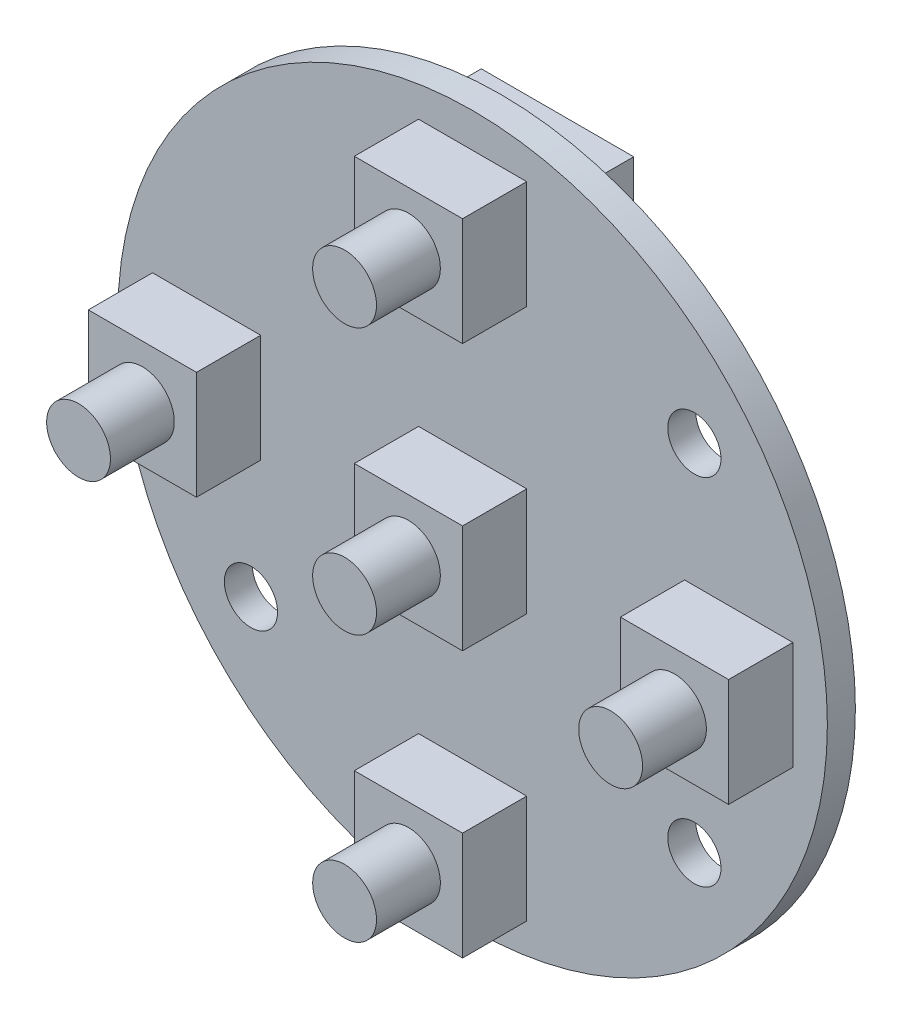
ISO-10303-21;
HEADER;
FILE_DESCRIPTION(('STEP AP214'),'2;1');
FILE_NAME('part.step','',(''),(''),'','','');
FILE_SCHEMA(('AUTOMOTIVE_DESIGN { 1 0 10303 214 1 1 1 1 }'));
ENDSEC;
DATA;
#1=APPLICATION_CONTEXT('core data for automotive mechanical design processes');
#2=APPLICATION_PROTOCOL_DEFINITION('international standard','automotive_design',2000,#1);
#3=PRODUCT_CONTEXT('',#1,'mechanical');
#4=PRODUCT('Part','Part','',(#3));
#5=PRODUCT_RELATED_PRODUCT_CATEGORY('part','',(#4));
#6=PRODUCT_DEFINITION_FORMATION('','',#4);
#7=PRODUCT_DEFINITION_CONTEXT('part definition',#1,'design');
#8=PRODUCT_DEFINITION('design','',#6,#7);
#9=PRODUCT_DEFINITION_SHAPE('','',#8);
#10=(LENGTH_UNIT() NAMED_UNIT(*) SI_UNIT(.MILLI.,.METRE.));
#11=(NAMED_UNIT(*) PLANE_ANGLE_UNIT() SI_UNIT($,.RADIAN.));
#12=(NAMED_UNIT(*) SI_UNIT($,.STERADIAN.) SOLID_ANGLE_UNIT());
#13=UNCERTAINTY_MEASURE_WITH_UNIT(LENGTH_MEASURE(1.E-05),#10,'distance_accuracy_value','');
#14=(GEOMETRIC_REPRESENTATION_CONTEXT(3) GLOBAL_UNCERTAINTY_ASSIGNED_CONTEXT((#13)) GLOBAL_UNIT_ASSIGNED_CONTEXT((#10,
#11,#12)) REPRESENTATION_CONTEXT('',''));
#15=CARTESIAN_POINT('',(0.,0.,0.));
#16=DIRECTION('',(0.,0.,1.));
#17=DIRECTION('',(1.,0.,0.));
#18=AXIS2_PLACEMENT_3D('',#15,#16,#17);
#19=CARTESIAN_POINT('',(0.,0.,1.58));
#20=DIRECTION('',(0.,0.,1.));
#21=DIRECTION('',(1.,0.,0.));
#22=AXIS2_PLACEMENT_3D('',#19,#20,#21);
#23=PLANE('',#22);
#24=CARTESIAN_POINT('',(12.5,-10.,1.58));
#25=DIRECTION('',(0.,0.,1.));
#26=DIRECTION('',(1.,0.,0.));
#27=AXIS2_PLACEMENT_3D('',#24,#25,#26);
#28=CIRCLE('',#27,1.5);
#29=CARTESIAN_POINT('',(14.,-10.,1.58));
#30=VERTEX_POINT('',#29);
#31=EDGE_CURVE('E441',#30,#30,#28,.T.);
#32=ORIENTED_EDGE('',*,*,#31,.F.);
#33=EDGE_LOOP('',(#32));
#34=FACE_BOUND('',#33,.T.);
#35=CARTESIAN_POINT('',(0.,0.,1.58));
#36=DIRECTION('',(0.,0.,1.));
#37=DIRECTION('',(1.,0.,0.));
#38=AXIS2_PLACEMENT_3D('',#35,#36,#37);
#39=CIRCLE('',#38,20.);
#40=CARTESIAN_POINT('',(20.,0.,1.58));
#41=VERTEX_POINT('',#40);
#42=EDGE_CURVE('E453',#41,#41,#39,.T.);
#43=ORIENTED_EDGE('',*,*,#42,.T.);
#44=EDGE_LOOP('',(#43));
#45=FACE_BOUND('',#44,.T.);
#46=CARTESIAN_POINT('',(-12.5,-10.,1.58));
#47=DIRECTION('',(0.,0.,1.));
#48=DIRECTION('',(1.,0.,0.));
#49=AXIS2_PLACEMENT_3D('',#46,#47,#48);
#50=CIRCLE('',#49,1.5);
#51=CARTESIAN_POINT('',(-11.,-10.,1.58));
#52=VERTEX_POINT('',#51);
#53=EDGE_CURVE('E447',#52,#52,#50,.T.);
#54=ORIENTED_EDGE('',*,*,#53,.F.);
#55=EDGE_LOOP('',(#54));
#56=FACE_BOUND('',#55,.T.);
#57=CARTESIAN_POINT('',(12.5,10.,1.58));
#58=DIRECTION('',(0.,0.,1.));
#59=DIRECTION('',(1.,0.,0.));
#60=AXIS2_PLACEMENT_3D('',#57,#58,#59);
#61=CIRCLE('',#60,1.5);
#62=CARTESIAN_POINT('',(14.,10.,1.58));
#63=VERTEX_POINT('',#62);
#64=EDGE_CURVE('E435',#63,#63,#61,.T.);
#65=ORIENTED_EDGE('',*,*,#64,.F.);
#66=EDGE_LOOP('',(#65));
#67=FACE_BOUND('',#66,.T.);
#68=DIRECTION('',(1.,0.,0.));
#69=VECTOR('',#68,1.);
#70=CARTESIAN_POINT('',(-18.05,-3.04999999999999,1.58));
#71=LINE('',#70,#69);
#72=CARTESIAN_POINT('',(-18.05,-3.04999999999999,1.58));
#73=VERTEX_POINT('',#72);
#74=CARTESIAN_POINT('',(-11.95,-3.04999999999999,1.58));
#75=VERTEX_POINT('',#74);
#76=EDGE_CURVE('E425',#73,#75,#71,.T.);
#77=ORIENTED_EDGE('',*,*,#76,.F.);
#78=DIRECTION('',(0.,-1.,0.));
#79=VECTOR('',#78,1.);
#80=CARTESIAN_POINT('',(-18.05,3.05,1.58));
#81=LINE('',#80,#79);
#82=CARTESIAN_POINT('',(-18.05,3.05,1.58));
#83=VERTEX_POINT('',#82);
#84=EDGE_CURVE('E422',#83,#73,#81,.T.);
#85=ORIENTED_EDGE('',*,*,#84,.F.);
#86=DIRECTION('',(-1.,0.,0.));
#87=VECTOR('',#86,1.);
#88=CARTESIAN_POINT('',(-18.05,3.05,1.58));
#89=LINE('',#88,#87);
#90=CARTESIAN_POINT('',(-11.95,3.05,1.58));
#91=VERTEX_POINT('',#90);
#92=EDGE_CURVE('E431',#91,#83,#89,.T.);
#93=ORIENTED_EDGE('',*,*,#92,.F.);
#94=DIRECTION('',(0.,1.,0.));
#95=VECTOR('',#94,1.);
#96=CARTESIAN_POINT('',(-11.95,3.05,1.58));
#97=LINE('',#96,#95);
#98=EDGE_CURVE('E428',#75,#91,#97,.T.);
#99=ORIENTED_EDGE('',*,*,#98,.F.);
#100=EDGE_LOOP('',(#77,#85,#93,#99));
#101=FACE_BOUND('',#100,.T.);
#102=DIRECTION('',(1.,0.,0.));
#103=VECTOR('',#102,1.);
#104=CARTESIAN_POINT('',(11.95,-3.04999999999999,1.58));
#105=LINE('',#104,#103);
#106=CARTESIAN_POINT('',(11.95,-3.04999999999999,1.58));
#107=VERTEX_POINT('',#106);
#108=CARTESIAN_POINT('',(18.05,-3.04999999999999,1.58));
#109=VERTEX_POINT('',#108);
#110=EDGE_CURVE('E413',#107,#109,#105,.T.);
#111=ORIENTED_EDGE('',*,*,#110,.F.);
#112=DIRECTION('',(0.,-1.,0.));
#113=VECTOR('',#112,1.);
#114=CARTESIAN_POINT('',(11.95,3.05,1.58));
#115=LINE('',#114,#113);
#116=CARTESIAN_POINT('',(11.95,3.05,1.58));
#117=VERTEX_POINT('',#116);
#118=EDGE_CURVE('E410',#117,#107,#115,.T.);
#119=ORIENTED_EDGE('',*,*,#118,.F.);
#120=DIRECTION('',(-1.,0.,0.));
#121=VECTOR('',#120,1.);
#122=CARTESIAN_POINT('',(11.95,3.05,1.58));
#123=LINE('',#122,#121);
#124=CARTESIAN_POINT('',(18.05,3.05,1.58));
#125=VERTEX_POINT('',#124);
#126=EDGE_CURVE('E419',#125,#117,#123,.T.);
#127=ORIENTED_EDGE('',*,*,#126,.F.);
#128=DIRECTION('',(0.,1.,0.));
#129=VECTOR('',#128,1.);
#130=CARTESIAN_POINT('',(18.05,3.05,1.58));
#131=LINE('',#130,#129);
#132=EDGE_CURVE('E416',#109,#125,#131,.T.);
#133=ORIENTED_EDGE('',*,*,#132,.F.);
#134=EDGE_LOOP('',(#111,#119,#127,#133));
#135=FACE_BOUND('',#134,.T.);
#136=DIRECTION('',(1.,0.,0.));
#137=VECTOR('',#136,1.);
#138=CARTESIAN_POINT('',(-3.05,11.95,1.58));
#139=LINE('',#138,#137);
#140=CARTESIAN_POINT('',(-3.05,11.95,1.58));
#141=VERTEX_POINT('',#140);
#142=CARTESIAN_POINT('',(3.05,11.95,1.58));
#143=VERTEX_POINT('',#142);
#144=EDGE_CURVE('E401',#141,#143,#139,.T.);
#145=ORIENTED_EDGE('',*,*,#144,.F.);
#146=DIRECTION('',(0.,-1.,0.));
#147=VECTOR('',#146,1.);
#148=CARTESIAN_POINT('',(-3.05,18.05,1.58));
#149=LINE('',#148,#147);
#150=CARTESIAN_POINT('',(-3.05,18.05,1.58));
#151=VERTEX_POINT('',#150);
#152=EDGE_CURVE('E398',#151,#141,#149,.T.);
#153=ORIENTED_EDGE('',*,*,#152,.F.);
#154=DIRECTION('',(-1.,0.,0.));
#155=VECTOR('',#154,1.);
#156=CARTESIAN_POINT('',(-3.05,18.05,1.58));
#157=LINE('',#156,#155);
#158=CARTESIAN_POINT('',(3.05,18.05,1.58));
#159=VERTEX_POINT('',#158);
#160=EDGE_CURVE('E407',#159,#151,#157,.T.);
#161=ORIENTED_EDGE('',*,*,#160,.F.);
#162=DIRECTION('',(0.,1.,0.));
#163=VECTOR('',#162,1.);
#164=CARTESIAN_POINT('',(3.05,18.05,1.58));
#165=LINE('',#164,#163);
#166=EDGE_CURVE('E404',#143,#159,#165,.T.);
#167=ORIENTED_EDGE('',*,*,#166,.F.);
#168=EDGE_LOOP('',(#145,#153,#161,#167));
#169=FACE_BOUND('',#168,.T.);
#170=DIRECTION('',(1.,0.,0.));
#171=VECTOR('',#170,1.);
#172=CARTESIAN_POINT('',(-3.04999999999999,-18.05,1.58));
#173=LINE('',#172,#171);
#174=CARTESIAN_POINT('',(-3.04999999999999,-18.05,1.58));
#175=VERTEX_POINT('',#174);
#176=CARTESIAN_POINT('',(3.05,-18.05,1.58));
#177=VERTEX_POINT('',#176);
#178=EDGE_CURVE('E389',#175,#177,#173,.T.);
#179=ORIENTED_EDGE('',*,*,#178,.F.);
#180=DIRECTION('',(0.,-1.,0.));
#181=VECTOR('',#180,1.);
#182=CARTESIAN_POINT('',(-3.05,-11.95,1.58));
#183=LINE('',#182,#181);
#184=CARTESIAN_POINT('',(-3.05,-11.95,1.58));
#185=VERTEX_POINT('',#184);
#186=EDGE_CURVE('E386',#185,#175,#183,.T.);
#187=ORIENTED_EDGE('',*,*,#186,.F.);
#188=DIRECTION('',(-1.,0.,0.));
#189=VECTOR('',#188,1.);
#190=CARTESIAN_POINT('',(-3.05,-11.95,1.58));
#191=LINE('',#190,#189);
#192=CARTESIAN_POINT('',(3.05,-11.95,1.58));
#193=VERTEX_POINT('',#192);
#194=EDGE_CURVE('E395',#193,#185,#191,.T.);
#195=ORIENTED_EDGE('',*,*,#194,.F.);
#196=DIRECTION('',(0.,1.,0.));
#197=VECTOR('',#196,1.);
#198=CARTESIAN_POINT('',(3.05,-11.95,1.58));
#199=LINE('',#198,#197);
#200=EDGE_CURVE('E392',#177,#193,#199,.T.);
#201=ORIENTED_EDGE('',*,*,#200,.F.);
#202=EDGE_LOOP('',(#179,#187,#195,#201));
#203=FACE_BOUND('',#202,.T.);
#204=DIRECTION('',(-1.,0.,0.));
#205=VECTOR('',#204,1.);
#206=CARTESIAN_POINT('',(-3.05,3.05,1.58));
#207=LINE('',#206,#205);
#208=CARTESIAN_POINT('',(3.05,3.05,1.58));
#209=VERTEX_POINT('',#208);
#210=CARTESIAN_POINT('',(-3.05,3.05,1.58));
#211=VERTEX_POINT('',#210);
#212=EDGE_CURVE('E380',#209,#211,#207,.T.);
#213=ORIENTED_EDGE('',*,*,#212,.F.);
#214=DIRECTION('',(0.,1.,0.));
#215=VECTOR('',#214,1.);
#216=CARTESIAN_POINT('',(3.05,-3.05,1.58));
#217=LINE('',#216,#215);
#218=CARTESIAN_POINT('',(3.05,-3.05,1.58));
#219=VERTEX_POINT('',#218);
#220=EDGE_CURVE('E369',#219,#209,#217,.T.);
#221=ORIENTED_EDGE('',*,*,#220,.F.);
#222=DIRECTION('',(1.,0.,0.));
#223=VECTOR('',#222,1.);
#224=CARTESIAN_POINT('',(-3.05,-3.05,1.58));
#225=LINE('',#224,#223);
#226=CARTESIAN_POINT('',(-3.05,-3.05,1.58));
#227=VERTEX_POINT('',#226);
#228=EDGE_CURVE('E55',#227,#219,#225,.T.);
#229=ORIENTED_EDGE('',*,*,#228,.F.);
#230=DIRECTION('',(0.,-1.,0.));
#231=VECTOR('',#230,1.);
#232=CARTESIAN_POINT('',(-3.05,-3.05,1.58));
#233=LINE('',#232,#231);
#234=EDGE_CURVE('E383',#211,#227,#233,.T.);
#235=ORIENTED_EDGE('',*,*,#234,.F.);
#236=EDGE_LOOP('',(#213,#221,#229,#235));
#237=FACE_BOUND('',#236,.T.);
#238=ADVANCED_FACE('F32',(#34,#45,#56,#67,#101,#135,#169,#203,#237),#23,.T.);
#239=CARTESIAN_POINT('',(0.,0.,0.));
#240=DIRECTION('',(0.,0.,1.));
#241=DIRECTION('',(1.,0.,0.));
#242=AXIS2_PLACEMENT_3D('',#239,#240,#241);
#243=PLANE('',#242);
#244=DIRECTION('',(1.,0.,0.));
#245=VECTOR('',#244,1.);
#246=CARTESIAN_POINT('',(-11.01,-9.52,0.));
#247=LINE('',#246,#245);
#248=CARTESIAN_POINT('',(-11.01,-9.52,0.));
#249=VERTEX_POINT('',#248);
#250=CARTESIAN_POINT('',(-2.42,-9.52,0.));
#251=VERTEX_POINT('',#250);
#252=EDGE_CURVE('E218',#249,#251,#247,.T.);
#253=ORIENTED_EDGE('',*,*,#252,.T.);
#254=DIRECTION('',(0.,1.,0.));
#255=VECTOR('',#254,1.);
#256=CARTESIAN_POINT('',(-2.42,10.78,0.));
#257=LINE('',#256,#255);
#258=CARTESIAN_POINT('',(-2.42,10.78,0.));
#259=VERTEX_POINT('',#258);
#260=EDGE_CURVE('E225',#251,#259,#257,.T.);
#261=ORIENTED_EDGE('',*,*,#260,.T.);
#262=DIRECTION('',(-1.,0.,0.));
#263=VECTOR('',#262,1.);
#264=CARTESIAN_POINT('',(-11.01,10.78,0.));
#265=LINE('',#264,#263);
#266=CARTESIAN_POINT('',(-11.01,10.78,0.));
#267=VERTEX_POINT('',#266);
#268=EDGE_CURVE('E198',#259,#267,#265,.T.);
#269=ORIENTED_EDGE('',*,*,#268,.T.);
#270=DIRECTION('',(0.,-1.,0.));
#271=VECTOR('',#270,1.);
#272=CARTESIAN_POINT('',(-11.01,10.78,0.));
#273=LINE('',#272,#271);
#274=EDGE_CURVE('E47',#267,#249,#273,.T.);
#275=ORIENTED_EDGE('',*,*,#274,.T.);
#276=EDGE_LOOP('',(#253,#261,#269,#275));
#277=FACE_BOUND('',#276,.T.);
#278=CARTESIAN_POINT('',(12.5,10.,0.));
#279=DIRECTION('',(0.,0.,1.));
#280=DIRECTION('',(1.,0.,0.));
#281=AXIS2_PLACEMENT_3D('',#278,#279,#280);
#282=CIRCLE('',#281,1.5);
#283=CARTESIAN_POINT('',(14.,10.,0.));
#284=VERTEX_POINT('',#283);
#285=EDGE_CURVE('E434',#284,#284,#282,.T.);
#286=ORIENTED_EDGE('',*,*,#285,.T.);
#287=EDGE_LOOP('',(#286));
#288=FACE_BOUND('',#287,.T.);
#289=CARTESIAN_POINT('',(12.5,-10.,0.));
#290=DIRECTION('',(0.,0.,1.));
#291=DIRECTION('',(1.,0.,0.));
#292=AXIS2_PLACEMENT_3D('',#289,#290,#291);
#293=CIRCLE('',#292,1.5);
#294=CARTESIAN_POINT('',(14.,-10.,0.));
#295=VERTEX_POINT('',#294);
#296=EDGE_CURVE('E438',#295,#295,#293,.T.);
#297=ORIENTED_EDGE('',*,*,#296,.T.);
#298=EDGE_LOOP('',(#297));
#299=FACE_BOUND('',#298,.T.);
#300=CARTESIAN_POINT('',(-12.5,-10.,0.));
#301=DIRECTION('',(0.,0.,1.));
#302=DIRECTION('',(1.,0.,0.));
#303=AXIS2_PLACEMENT_3D('',#300,#301,#302);
#304=CIRCLE('',#303,1.5);
#305=CARTESIAN_POINT('',(-11.,-10.,0.));
#306=VERTEX_POINT('',#305);
#307=EDGE_CURVE('E444',#306,#306,#304,.T.);
#308=ORIENTED_EDGE('',*,*,#307,.T.);
#309=EDGE_LOOP('',(#308));
#310=FACE_BOUND('',#309,.T.);
#311=CARTESIAN_POINT('',(0.,0.,0.));
#312=DIRECTION('',(0.,0.,1.));
#313=DIRECTION('',(1.,0.,0.));
#314=AXIS2_PLACEMENT_3D('',#311,#312,#313);
#315=CIRCLE('',#314,20.);
#316=CARTESIAN_POINT('',(20.,0.,0.));
#317=VERTEX_POINT('',#316);
#318=EDGE_CURVE('E450',#317,#317,#315,.T.);
#319=ORIENTED_EDGE('',*,*,#318,.F.);
#320=EDGE_LOOP('',(#319));
#321=FACE_BOUND('',#320,.T.);
#322=ADVANCED_FACE('F481',(#277,#288,#299,#310,#321),#243,.F.);
#323=CARTESIAN_POINT('',(0.,0.,1.58));
#324=DIRECTION('',(0.,0.,-1.));
#325=DIRECTION('',(-1.,0.,0.));
#326=AXIS2_PLACEMENT_3D('',#323,#324,#325);
#327=CYLINDRICAL_SURFACE('',#326,20.);
#328=ORIENTED_EDGE('',*,*,#42,.F.);
#329=EDGE_LOOP('',(#328));
#330=FACE_BOUND('',#329,.T.);
#331=ORIENTED_EDGE('',*,*,#318,.T.);
#332=EDGE_LOOP('',(#331));
#333=FACE_BOUND('',#332,.T.);
#334=ADVANCED_FACE('F34',(#330,#333),#327,.T.);
#335=CARTESIAN_POINT('',(-12.5,-10.,1.58));
#336=DIRECTION('',(0.,0.,-1.));
#337=DIRECTION('',(-1.,0.,0.));
#338=AXIS2_PLACEMENT_3D('',#335,#336,#337);
#339=CYLINDRICAL_SURFACE('',#338,1.5);
#340=ORIENTED_EDGE('',*,*,#53,.T.);
#341=EDGE_LOOP('',(#340));
#342=FACE_BOUND('',#341,.T.);
#343=ORIENTED_EDGE('',*,*,#307,.F.);
#344=EDGE_LOOP('',(#343));
#345=FACE_BOUND('',#344,.T.);
#346=ADVANCED_FACE('F577',(#342,#345),#339,.F.);
#347=CARTESIAN_POINT('',(12.5,-10.,1.58));
#348=DIRECTION('',(0.,0.,-1.));
#349=DIRECTION('',(-1.,0.,0.));
#350=AXIS2_PLACEMENT_3D('',#347,#348,#349);
#351=CYLINDRICAL_SURFACE('',#350,1.5);
#352=ORIENTED_EDGE('',*,*,#31,.T.);
#353=EDGE_LOOP('',(#352));
#354=FACE_BOUND('',#353,.T.);
#355=ORIENTED_EDGE('',*,*,#296,.F.);
#356=EDGE_LOOP('',(#355));
#357=FACE_BOUND('',#356,.T.);
#358=ADVANCED_FACE('F573',(#354,#357),#351,.F.);
#359=CARTESIAN_POINT('',(12.5,10.,1.58));
#360=DIRECTION('',(0.,0.,-1.));
#361=DIRECTION('',(-1.,0.,0.));
#362=AXIS2_PLACEMENT_3D('',#359,#360,#361);
#363=CYLINDRICAL_SURFACE('',#362,1.5);
#364=ORIENTED_EDGE('',*,*,#64,.T.);
#365=EDGE_LOOP('',(#364));
#366=FACE_BOUND('',#365,.T.);
#367=ORIENTED_EDGE('',*,*,#285,.F.);
#368=EDGE_LOOP('',(#367));
#369=FACE_BOUND('',#368,.T.);
#370=ADVANCED_FACE('F569',(#366,#369),#363,.F.);
#371=CARTESIAN_POINT('',(-3.05,18.05,5.2));
#372=DIRECTION('',(-1.,0.,0.));
#373=DIRECTION('',(0.,0.,1.));
#374=AXIS2_PLACEMENT_3D('',#371,#372,#373);
#375=PLANE('',#374);
#376=DIRECTION('',(0.,0.,-1.));
#377=VECTOR('',#376,1.);
#378=CARTESIAN_POINT('',(-3.05,18.05,5.2));
#379=LINE('',#378,#377);
#380=CARTESIAN_POINT('',(-3.05,18.05,5.2));
#381=VERTEX_POINT('',#380);
#382=EDGE_CURVE('E365',#381,#151,#379,.T.);
#383=ORIENTED_EDGE('',*,*,#382,.T.);
#384=ORIENTED_EDGE('',*,*,#152,.T.);
#385=DIRECTION('',(0.,0.,-1.));
#386=VECTOR('',#385,1.);
#387=CARTESIAN_POINT('',(-3.05,11.95,5.2));
#388=LINE('',#387,#386);
#389=CARTESIAN_POINT('',(-3.05,11.95,5.2));
#390=VERTEX_POINT('',#389);
#391=EDGE_CURVE('E366',#390,#141,#388,.T.);
#392=ORIENTED_EDGE('',*,*,#391,.F.);
#393=DIRECTION('',(0.,1.,0.));
#394=VECTOR('',#393,1.);
#395=CARTESIAN_POINT('',(-3.05,18.05,5.2));
#396=LINE('',#395,#394);
#397=EDGE_CURVE('E345',#390,#381,#396,.T.);
#398=ORIENTED_EDGE('',*,*,#397,.T.);
#399=EDGE_LOOP('',(#383,#384,#392,#398));
#400=FACE_BOUND('',#399,.T.);
#401=ADVANCED_FACE('F559',(#400),#375,.T.);
#402=CARTESIAN_POINT('',(-3.05,11.95,5.2));
#403=DIRECTION('',(0.,-1.,0.));
#404=DIRECTION('',(0.,0.,-1.));
#405=AXIS2_PLACEMENT_3D('',#402,#403,#404);
#406=PLANE('',#405);
#407=ORIENTED_EDGE('',*,*,#391,.T.);
#408=ORIENTED_EDGE('',*,*,#144,.T.);
#409=DIRECTION('',(0.,0.,-1.));
#410=VECTOR('',#409,1.);
#411=CARTESIAN_POINT('',(3.05,11.95,5.2));
#412=LINE('',#411,#410);
#413=CARTESIAN_POINT('',(3.05,11.95,5.2));
#414=VERTEX_POINT('',#413);
#415=EDGE_CURVE('E370',#414,#143,#412,.T.);
#416=ORIENTED_EDGE('',*,*,#415,.F.);
#417=DIRECTION('',(-1.,0.,0.));
#418=VECTOR('',#417,1.);
#419=CARTESIAN_POINT('',(-3.05,11.95,5.2));
#420=LINE('',#419,#418);
#421=EDGE_CURVE('E362',#414,#390,#420,.T.);
#422=ORIENTED_EDGE('',*,*,#421,.T.);
#423=EDGE_LOOP('',(#407,#408,#416,#422));
#424=FACE_BOUND('',#423,.T.);
#425=ADVANCED_FACE('F555',(#424),#406,.T.);
#426=CARTESIAN_POINT('',(3.05,18.05,5.2));
#427=DIRECTION('',(1.,0.,0.));
#428=DIRECTION('',(0.,0.,-1.));
#429=AXIS2_PLACEMENT_3D('',#426,#427,#428);
#430=PLANE('',#429);
#431=ORIENTED_EDGE('',*,*,#415,.T.);
#432=ORIENTED_EDGE('',*,*,#166,.T.);
#433=DIRECTION('',(0.,0.,-1.));
#434=VECTOR('',#433,1.);
#435=CARTESIAN_POINT('',(3.05,18.05,5.2));
#436=LINE('',#435,#434);
#437=CARTESIAN_POINT('',(3.05,18.05,5.2));
#438=VERTEX_POINT('',#437);
#439=EDGE_CURVE('E373',#438,#159,#436,.T.);
#440=ORIENTED_EDGE('',*,*,#439,.F.);
#441=DIRECTION('',(0.,-1.,0.));
#442=VECTOR('',#441,1.);
#443=CARTESIAN_POINT('',(3.05,18.05,5.2));
#444=LINE('',#443,#442);
#445=EDGE_CURVE('E359',#438,#414,#444,.T.);
#446=ORIENTED_EDGE('',*,*,#445,.T.);
#447=EDGE_LOOP('',(#431,#432,#440,#446));
#448=FACE_BOUND('',#447,.T.);
#449=ADVANCED_FACE('F558',(#448),#430,.T.);
#450=CARTESIAN_POINT('',(-3.05,18.05,5.2));
#451=DIRECTION('',(0.,1.,0.));
#452=DIRECTION('',(0.,0.,1.));
#453=AXIS2_PLACEMENT_3D('',#450,#451,#452);
#454=PLANE('',#453);
#455=ORIENTED_EDGE('',*,*,#439,.T.);
#456=ORIENTED_EDGE('',*,*,#160,.T.);
#457=ORIENTED_EDGE('',*,*,#382,.F.);
#458=DIRECTION('',(1.,0.,0.));
#459=VECTOR('',#458,1.);
#460=CARTESIAN_POINT('',(-3.05,18.05,5.2));
#461=LINE('',#460,#459);
#462=EDGE_CURVE('E356',#381,#438,#461,.T.);
#463=ORIENTED_EDGE('',*,*,#462,.T.);
#464=EDGE_LOOP('',(#455,#456,#457,#463));
#465=FACE_BOUND('',#464,.T.);
#466=ADVANCED_FACE('F553',(#465),#454,.T.);
#467=CARTESIAN_POINT('',(0.,0.,5.2));
#468=DIRECTION('',(0.,0.,1.));
#469=DIRECTION('',(1.,0.,0.));
#470=AXIS2_PLACEMENT_3D('',#467,#468,#469);
#471=PLANE('',#470);
#472=CARTESIAN_POINT('',(0.,15.,5.2));
#473=DIRECTION('',(0.,0.,1.));
#474=DIRECTION('',(1.,0.,0.));
#475=AXIS2_PLACEMENT_3D('',#472,#473,#474);
#476=CIRCLE('',#475,1.8);
#477=CARTESIAN_POINT('',(1.8,15.,5.2));
#478=VERTEX_POINT('',#477);
#479=EDGE_CURVE('E243',#478,#478,#476,.T.);
#480=ORIENTED_EDGE('',*,*,#479,.F.);
#481=EDGE_LOOP('',(#480));
#482=FACE_BOUND('',#481,.T.);
#483=ORIENTED_EDGE('',*,*,#397,.F.);
#484=ORIENTED_EDGE('',*,*,#421,.F.);
#485=ORIENTED_EDGE('',*,*,#445,.F.);
#486=ORIENTED_EDGE('',*,*,#462,.F.);
#487=EDGE_LOOP('',(#483,#484,#485,#486));
#488=FACE_BOUND('',#487,.T.);
#489=ADVANCED_FACE('F549',(#482,#488),#471,.T.);
#490=CARTESIAN_POINT('',(18.05,-3.04999999999999,5.2));
#491=DIRECTION('',(1.,0.,0.));
#492=DIRECTION('',(0.,0.,-1.));
#493=AXIS2_PLACEMENT_3D('',#490,#491,#492);
#494=PLANE('',#493);
#495=DIRECTION('',(0.,0.,-1.));
#496=VECTOR('',#495,1.);
#497=CARTESIAN_POINT('',(18.05,-3.04999999999999,5.2));
#498=LINE('',#497,#496);
#499=CARTESIAN_POINT('',(18.05,-3.04999999999999,5.2));
#500=VERTEX_POINT('',#499);
#501=EDGE_CURVE('E341',#500,#109,#498,.T.);
#502=ORIENTED_EDGE('',*,*,#501,.T.);
#503=ORIENTED_EDGE('',*,*,#132,.T.);
#504=DIRECTION('',(0.,0.,-1.));
#505=VECTOR('',#504,1.);
#506=CARTESIAN_POINT('',(18.05,3.05,5.2));
#507=LINE('',#506,#505);
#508=CARTESIAN_POINT('',(18.05,3.05,5.2));
#509=VERTEX_POINT('',#508);
#510=EDGE_CURVE('E342',#509,#125,#507,.T.);
#511=ORIENTED_EDGE('',*,*,#510,.F.);
#512=DIRECTION('',(0.,-1.,0.));
#513=VECTOR('',#512,1.);
#514=CARTESIAN_POINT('',(18.05,-3.04999999999999,5.2));
#515=LINE('',#514,#513);
#516=EDGE_CURVE('E321',#509,#500,#515,.T.);
#517=ORIENTED_EDGE('',*,*,#516,.T.);
#518=EDGE_LOOP('',(#502,#503,#511,#517));
#519=FACE_BOUND('',#518,.T.);
#520=ADVANCED_FACE('F539',(#519),#494,.T.);
#521=CARTESIAN_POINT('',(18.05,3.05,5.2));
#522=DIRECTION('',(0.,1.,0.));
#523=DIRECTION('',(0.,0.,1.));
#524=AXIS2_PLACEMENT_3D('',#521,#522,#523);
#525=PLANE('',#524);
#526=ORIENTED_EDGE('',*,*,#510,.T.);
#527=ORIENTED_EDGE('',*,*,#126,.T.);
#528=DIRECTION('',(0.,0.,-1.));
#529=VECTOR('',#528,1.);
#530=CARTESIAN_POINT('',(11.95,3.05,5.2));
#531=LINE('',#530,#529);
#532=CARTESIAN_POINT('',(11.95,3.05,5.2));
#533=VERTEX_POINT('',#532);
#534=EDGE_CURVE('E346',#533,#117,#531,.T.);
#535=ORIENTED_EDGE('',*,*,#534,.F.);
#536=DIRECTION('',(1.,0.,0.));
#537=VECTOR('',#536,1.);
#538=CARTESIAN_POINT('',(18.05,3.05,5.2));
#539=LINE('',#538,#537);
#540=EDGE_CURVE('E338',#533,#509,#539,.T.);
#541=ORIENTED_EDGE('',*,*,#540,.T.);
#542=EDGE_LOOP('',(#526,#527,#535,#541));
#543=FACE_BOUND('',#542,.T.);
#544=ADVANCED_FACE('F535',(#543),#525,.T.);
#545=CARTESIAN_POINT('',(11.95,-3.04999999999999,5.2));
#546=DIRECTION('',(-1.,0.,0.));
#547=DIRECTION('',(0.,0.,1.));
#548=AXIS2_PLACEMENT_3D('',#545,#546,#547);
#549=PLANE('',#548);
#550=ORIENTED_EDGE('',*,*,#534,.T.);
#551=ORIENTED_EDGE('',*,*,#118,.T.);
#552=DIRECTION('',(0.,0.,-1.));
#553=VECTOR('',#552,1.);
#554=CARTESIAN_POINT('',(11.95,-3.04999999999999,5.2));
#555=LINE('',#554,#553);
#556=CARTESIAN_POINT('',(11.95,-3.04999999999999,5.2));
#557=VERTEX_POINT('',#556);
#558=EDGE_CURVE('E349',#557,#107,#555,.T.);
#559=ORIENTED_EDGE('',*,*,#558,.F.);
#560=DIRECTION('',(0.,1.,0.));
#561=VECTOR('',#560,1.);
#562=CARTESIAN_POINT('',(11.95,-3.04999999999999,5.2));
#563=LINE('',#562,#561);
#564=EDGE_CURVE('E335',#557,#533,#563,.T.);
#565=ORIENTED_EDGE('',*,*,#564,.T.);
#566=EDGE_LOOP('',(#550,#551,#559,#565));
#567=FACE_BOUND('',#566,.T.);
#568=ADVANCED_FACE('F538',(#567),#549,.T.);
#569=CARTESIAN_POINT('',(18.05,-3.04999999999999,5.2));
#570=DIRECTION('',(0.,-1.,0.));
#571=DIRECTION('',(0.,0.,-1.));
#572=AXIS2_PLACEMENT_3D('',#569,#570,#571);
#573=PLANE('',#572);
#574=ORIENTED_EDGE('',*,*,#558,.T.);
#575=ORIENTED_EDGE('',*,*,#110,.T.);
#576=ORIENTED_EDGE('',*,*,#501,.F.);
#577=DIRECTION('',(-1.,0.,0.));
#578=VECTOR('',#577,1.);
#579=CARTESIAN_POINT('',(18.05,-3.04999999999999,5.2));
#580=LINE('',#579,#578);
#581=EDGE_CURVE('E332',#500,#557,#580,.T.);
#582=ORIENTED_EDGE('',*,*,#581,.T.);
#583=EDGE_LOOP('',(#574,#575,#576,#582));
#584=FACE_BOUND('',#583,.T.);
#585=ADVANCED_FACE('F533',(#584),#573,.T.);
#586=CARTESIAN_POINT('',(0.,0.,5.2));
#587=DIRECTION('',(0.,0.,1.));
#588=DIRECTION('',(1.,0.,0.));
#589=AXIS2_PLACEMENT_3D('',#586,#587,#588);
#590=PLANE('',#589);
#591=CARTESIAN_POINT('',(15.,0.,5.2));
#592=DIRECTION('',(0.,0.,1.));
#593=DIRECTION('',(1.,0.,0.));
#594=AXIS2_PLACEMENT_3D('',#591,#592,#593);
#595=CIRCLE('',#594,1.8);
#596=CARTESIAN_POINT('',(16.8,0.,5.2));
#597=VERTEX_POINT('',#596);
#598=EDGE_CURVE('E239',#597,#597,#595,.T.);
#599=ORIENTED_EDGE('',*,*,#598,.F.);
#600=EDGE_LOOP('',(#599));
#601=FACE_BOUND('',#600,.T.);
#602=ORIENTED_EDGE('',*,*,#516,.F.);
#603=ORIENTED_EDGE('',*,*,#540,.F.);
#604=ORIENTED_EDGE('',*,*,#564,.F.);
#605=ORIENTED_EDGE('',*,*,#581,.F.);
#606=EDGE_LOOP('',(#602,#603,#604,#605));
#607=FACE_BOUND('',#606,.T.);
#608=ADVANCED_FACE('F529',(#601,#607),#590,.T.);
#609=CARTESIAN_POINT('',(-11.95,3.05,5.2));
#610=DIRECTION('',(1.,0.,0.));
#611=DIRECTION('',(0.,0.,-1.));
#612=AXIS2_PLACEMENT_3D('',#609,#610,#611);
#613=PLANE('',#612);
#614=DIRECTION('',(0.,0.,-1.));
#615=VECTOR('',#614,1.);
#616=CARTESIAN_POINT('',(-11.95,-3.04999999999999,5.2));
#617=LINE('',#616,#615);
#618=CARTESIAN_POINT('',(-11.95,-3.04999999999999,5.2));
#619=VERTEX_POINT('',#618);
#620=EDGE_CURVE('E317',#619,#75,#617,.T.);
#621=ORIENTED_EDGE('',*,*,#620,.T.);
#622=ORIENTED_EDGE('',*,*,#98,.T.);
#623=DIRECTION('',(0.,0.,-1.));
#624=VECTOR('',#623,1.);
#625=CARTESIAN_POINT('',(-11.95,3.05,5.2));
#626=LINE('',#625,#624);
#627=CARTESIAN_POINT('',(-11.95,3.05,5.2));
#628=VERTEX_POINT('',#627);
#629=EDGE_CURVE('E318',#628,#91,#626,.T.);
#630=ORIENTED_EDGE('',*,*,#629,.F.);
#631=DIRECTION('',(0.,-1.,0.));
#632=VECTOR('',#631,1.);
#633=CARTESIAN_POINT('',(-11.95,3.05,5.2));
#634=LINE('',#633,#632);
#635=EDGE_CURVE('E297',#628,#619,#634,.T.);
#636=ORIENTED_EDGE('',*,*,#635,.T.);
#637=EDGE_LOOP('',(#621,#622,#630,#636));
#638=FACE_BOUND('',#637,.T.);
#639=ADVANCED_FACE('F519',(#638),#613,.T.);
#640=CARTESIAN_POINT('',(-11.95,3.05,5.2));
#641=DIRECTION('',(0.,1.,0.));
#642=DIRECTION('',(0.,0.,1.));
#643=AXIS2_PLACEMENT_3D('',#640,#641,#642);
#644=PLANE('',#643);
#645=ORIENTED_EDGE('',*,*,#629,.T.);
#646=ORIENTED_EDGE('',*,*,#92,.T.);
#647=DIRECTION('',(0.,0.,-1.));
#648=VECTOR('',#647,1.);
#649=CARTESIAN_POINT('',(-18.05,3.05,5.2));
#650=LINE('',#649,#648);
#651=CARTESIAN_POINT('',(-18.05,3.05,5.2));
#652=VERTEX_POINT('',#651);
#653=EDGE_CURVE('E322',#652,#83,#650,.T.);
#654=ORIENTED_EDGE('',*,*,#653,.F.);
#655=DIRECTION('',(1.,0.,0.));
#656=VECTOR('',#655,1.);
#657=CARTESIAN_POINT('',(-11.95,3.05,5.2));
#658=LINE('',#657,#656);
#659=EDGE_CURVE('E314',#652,#628,#658,.T.);
#660=ORIENTED_EDGE('',*,*,#659,.T.);
#661=EDGE_LOOP('',(#645,#646,#654,#660));
#662=FACE_BOUND('',#661,.T.);
#663=ADVANCED_FACE('F515',(#662),#644,.T.);
#664=CARTESIAN_POINT('',(-18.05,3.05,5.2));
#665=DIRECTION('',(-1.,0.,0.));
#666=DIRECTION('',(0.,0.,1.));
#667=AXIS2_PLACEMENT_3D('',#664,#665,#666);
#668=PLANE('',#667);
#669=ORIENTED_EDGE('',*,*,#653,.T.);
#670=ORIENTED_EDGE('',*,*,#84,.T.);
#671=DIRECTION('',(0.,0.,-1.));
#672=VECTOR('',#671,1.);
#673=CARTESIAN_POINT('',(-18.05,-3.04999999999999,5.2));
#674=LINE('',#673,#672);
#675=CARTESIAN_POINT('',(-18.05,-3.04999999999999,5.2));
#676=VERTEX_POINT('',#675);
#677=EDGE_CURVE('E325',#676,#73,#674,.T.);
#678=ORIENTED_EDGE('',*,*,#677,.F.);
#679=DIRECTION('',(0.,1.,0.));
#680=VECTOR('',#679,1.);
#681=CARTESIAN_POINT('',(-18.05,3.05,5.2));
#682=LINE('',#681,#680);
#683=EDGE_CURVE('E311',#676,#652,#682,.T.);
#684=ORIENTED_EDGE('',*,*,#683,.T.);
#685=EDGE_LOOP('',(#669,#670,#678,#684));
#686=FACE_BOUND('',#685,.T.);
#687=ADVANCED_FACE('F518',(#686),#668,.T.);
#688=CARTESIAN_POINT('',(-11.95,-3.04999999999999,5.2));
#689=DIRECTION('',(0.,-1.,0.));
#690=DIRECTION('',(0.,0.,-1.));
#691=AXIS2_PLACEMENT_3D('',#688,#689,#690);
#692=PLANE('',#691);
#693=ORIENTED_EDGE('',*,*,#677,.T.);
#694=ORIENTED_EDGE('',*,*,#76,.T.);
#695=ORIENTED_EDGE('',*,*,#620,.F.);
#696=DIRECTION('',(-1.,0.,0.));
#697=VECTOR('',#696,1.);
#698=CARTESIAN_POINT('',(-11.95,-3.04999999999999,5.2));
#699=LINE('',#698,#697);
#700=EDGE_CURVE('E308',#619,#676,#699,.T.);
#701=ORIENTED_EDGE('',*,*,#700,.T.);
#702=EDGE_LOOP('',(#693,#694,#695,#701));
#703=FACE_BOUND('',#702,.T.);
#704=ADVANCED_FACE('F513',(#703),#692,.T.);
#705=CARTESIAN_POINT('',(0.,0.,5.2));
#706=DIRECTION('',(0.,0.,-1.));
#707=DIRECTION('',(-1.,0.,0.));
#708=AXIS2_PLACEMENT_3D('',#705,#706,#707);
#709=PLANE('',#708);
#710=CARTESIAN_POINT('',(-15.,0.,5.2));
#711=DIRECTION('',(0.,0.,-1.));
#712=DIRECTION('',(-1.,0.,0.));
#713=AXIS2_PLACEMENT_3D('',#710,#711,#712);
#714=CIRCLE('',#713,1.8);
#715=CARTESIAN_POINT('',(-16.8,0.,5.2));
#716=VERTEX_POINT('',#715);
#717=EDGE_CURVE('E11',#716,#716,#714,.F.);
#718=ORIENTED_EDGE('',*,*,#717,.F.);
#719=EDGE_LOOP('',(#718));
#720=FACE_BOUND('',#719,.T.);
#721=ORIENTED_EDGE('',*,*,#635,.F.);
#722=ORIENTED_EDGE('',*,*,#659,.F.);
#723=ORIENTED_EDGE('',*,*,#683,.F.);
#724=ORIENTED_EDGE('',*,*,#700,.F.);
#725=EDGE_LOOP('',(#721,#722,#723,#724));
#726=FACE_BOUND('',#725,.T.);
#727=ADVANCED_FACE('F510',(#720,#726),#709,.F.);
#728=CARTESIAN_POINT('',(3.05,-3.05,5.2));
#729=DIRECTION('',(1.,0.,0.));
#730=DIRECTION('',(0.,0.,-1.));
#731=AXIS2_PLACEMENT_3D('',#728,#729,#730);
#732=PLANE('',#731);
#733=DIRECTION('',(0.,0.,-1.));
#734=VECTOR('',#733,1.);
#735=CARTESIAN_POINT('',(3.05,-3.05,5.2));
#736=LINE('',#735,#734);
#737=CARTESIAN_POINT('',(3.05,-3.05,5.2));
#738=VERTEX_POINT('',#737);
#739=EDGE_CURVE('E293',#738,#219,#736,.T.);
#740=ORIENTED_EDGE('',*,*,#739,.T.);
#741=ORIENTED_EDGE('',*,*,#220,.T.);
#742=DIRECTION('',(0.,0.,-1.));
#743=VECTOR('',#742,1.);
#744=CARTESIAN_POINT('',(3.05,3.05,5.2));
#745=LINE('',#744,#743);
#746=CARTESIAN_POINT('',(3.05,3.05,5.2));
#747=VERTEX_POINT('',#746);
#748=EDGE_CURVE('E294',#747,#209,#745,.T.);
#749=ORIENTED_EDGE('',*,*,#748,.F.);
#750=DIRECTION('',(0.,-1.,0.));
#751=VECTOR('',#750,1.);
#752=CARTESIAN_POINT('',(3.05,-3.05,5.2));
#753=LINE('',#752,#751);
#754=EDGE_CURVE('E273',#747,#738,#753,.T.);
#755=ORIENTED_EDGE('',*,*,#754,.T.);
#756=EDGE_LOOP('',(#740,#741,#749,#755));
#757=FACE_BOUND('',#756,.T.);
#758=ADVANCED_FACE('F486',(#757),#732,.T.);
#759=CARTESIAN_POINT('',(3.05,3.05,5.2));
#760=DIRECTION('',(0.,1.,0.));
#761=DIRECTION('',(0.,0.,1.));
#762=AXIS2_PLACEMENT_3D('',#759,#760,#761);
#763=PLANE('',#762);
#764=ORIENTED_EDGE('',*,*,#748,.T.);
#765=ORIENTED_EDGE('',*,*,#212,.T.);
#766=DIRECTION('',(0.,0.,-1.));
#767=VECTOR('',#766,1.);
#768=CARTESIAN_POINT('',(-3.05,3.05,5.2));
#769=LINE('',#768,#767);
#770=CARTESIAN_POINT('',(-3.05,3.05,5.2));
#771=VERTEX_POINT('',#770);
#772=EDGE_CURVE('E298',#771,#211,#769,.T.);
#773=ORIENTED_EDGE('',*,*,#772,.F.);
#774=DIRECTION('',(1.,0.,0.));
#775=VECTOR('',#774,1.);
#776=CARTESIAN_POINT('',(3.05,3.05,5.2));
#777=LINE('',#776,#775);
#778=EDGE_CURVE('E290',#771,#747,#777,.T.);
#779=ORIENTED_EDGE('',*,*,#778,.T.);
#780=EDGE_LOOP('',(#764,#765,#773,#779));
#781=FACE_BOUND('',#780,.T.);
#782=ADVANCED_FACE('F488',(#781),#763,.T.);
#783=CARTESIAN_POINT('',(-3.05,-3.05,5.2));
#784=DIRECTION('',(-1.,0.,0.));
#785=DIRECTION('',(0.,0.,1.));
#786=AXIS2_PLACEMENT_3D('',#783,#784,#785);
#787=PLANE('',#786);
#788=ORIENTED_EDGE('',*,*,#772,.T.);
#789=ORIENTED_EDGE('',*,*,#234,.T.);
#790=DIRECTION('',(0.,0.,-1.));
#791=VECTOR('',#790,1.);
#792=CARTESIAN_POINT('',(-3.05,-3.05,5.2));
#793=LINE('',#792,#791);
#794=CARTESIAN_POINT('',(-3.05,-3.05,5.2));
#795=VERTEX_POINT('',#794);
#796=EDGE_CURVE('E301',#795,#227,#793,.T.);
#797=ORIENTED_EDGE('',*,*,#796,.F.);
#798=DIRECTION('',(0.,1.,0.));
#799=VECTOR('',#798,1.);
#800=CARTESIAN_POINT('',(-3.05,-3.05,5.2));
#801=LINE('',#800,#799);
#802=EDGE_CURVE('E287',#795,#771,#801,.T.);
#803=ORIENTED_EDGE('',*,*,#802,.T.);
#804=EDGE_LOOP('',(#788,#789,#797,#803));
#805=FACE_BOUND('',#804,.T.);
#806=ADVANCED_FACE('F497',(#805),#787,.T.);
#807=CARTESIAN_POINT('',(3.05,-3.05,5.2));
#808=DIRECTION('',(0.,-1.,0.));
#809=DIRECTION('',(0.,0.,-1.));
#810=AXIS2_PLACEMENT_3D('',#807,#808,#809);
#811=PLANE('',#810);
#812=ORIENTED_EDGE('',*,*,#796,.T.);
#813=ORIENTED_EDGE('',*,*,#228,.T.);
#814=ORIENTED_EDGE('',*,*,#739,.F.);
#815=DIRECTION('',(-1.,0.,0.));
#816=VECTOR('',#815,1.);
#817=CARTESIAN_POINT('',(3.05,-3.05,5.2));
#818=LINE('',#817,#816);
#819=EDGE_CURVE('E284',#738,#795,#818,.T.);
#820=ORIENTED_EDGE('',*,*,#819,.T.);
#821=EDGE_LOOP('',(#812,#813,#814,#820));
#822=FACE_BOUND('',#821,.T.);
#823=ADVANCED_FACE('F495',(#822),#811,.T.);
#824=CARTESIAN_POINT('',(0.,0.,5.2));
#825=DIRECTION('',(0.,0.,1.));
#826=DIRECTION('',(1.,0.,0.));
#827=AXIS2_PLACEMENT_3D('',#824,#825,#826);
#828=PLANE('',#827);
#829=CARTESIAN_POINT('',(0.,0.,5.2));
#830=DIRECTION('',(0.,0.,1.));
#831=DIRECTION('',(1.,0.,0.));
#832=AXIS2_PLACEMENT_3D('',#829,#830,#831);
#833=CIRCLE('',#832,1.8);
#834=CARTESIAN_POINT('',(1.8,0.,5.2));
#835=VERTEX_POINT('',#834);
#836=EDGE_CURVE('E249',#835,#835,#833,.T.);
#837=ORIENTED_EDGE('',*,*,#836,.F.);
#838=EDGE_LOOP('',(#837));
#839=FACE_BOUND('',#838,.T.);
#840=ORIENTED_EDGE('',*,*,#754,.F.);
#841=ORIENTED_EDGE('',*,*,#778,.F.);
#842=ORIENTED_EDGE('',*,*,#802,.F.);
#843=ORIENTED_EDGE('',*,*,#819,.F.);
#844=EDGE_LOOP('',(#840,#841,#842,#843));
#845=FACE_BOUND('',#844,.T.);
#846=ADVANCED_FACE('F492',(#839,#845),#828,.T.);
#847=CARTESIAN_POINT('',(3.05,-11.95,5.2));
#848=DIRECTION('',(1.,0.,0.));
#849=DIRECTION('',(0.,0.,-1.));
#850=AXIS2_PLACEMENT_3D('',#847,#848,#849);
#851=PLANE('',#850);
#852=DIRECTION('',(0.,0.,-1.));
#853=VECTOR('',#852,1.);
#854=CARTESIAN_POINT('',(3.05,-18.05,5.2));
#855=LINE('',#854,#853);
#856=CARTESIAN_POINT('',(3.05,-18.05,5.2));
#857=VERTEX_POINT('',#856);
#858=EDGE_CURVE('E269',#857,#177,#855,.T.);
#859=ORIENTED_EDGE('',*,*,#858,.T.);
#860=ORIENTED_EDGE('',*,*,#200,.T.);
#861=DIRECTION('',(0.,0.,-1.));
#862=VECTOR('',#861,1.);
#863=CARTESIAN_POINT('',(3.05,-11.95,5.2));
#864=LINE('',#863,#862);
#865=CARTESIAN_POINT('',(3.05,-11.95,5.2));
#866=VERTEX_POINT('',#865);
#867=EDGE_CURVE('E270',#866,#193,#864,.T.);
#868=ORIENTED_EDGE('',*,*,#867,.F.);
#869=DIRECTION('',(0.,-1.,0.));
#870=VECTOR('',#869,1.);
#871=CARTESIAN_POINT('',(3.05,-11.95,5.2));
#872=LINE('',#871,#870);
#873=EDGE_CURVE('E255',#866,#857,#872,.T.);
#874=ORIENTED_EDGE('',*,*,#873,.T.);
#875=EDGE_LOOP('',(#859,#860,#868,#874));
#876=FACE_BOUND('',#875,.T.);
#877=ADVANCED_FACE('F478',(#876),#851,.T.);
#878=CARTESIAN_POINT('',(3.05,-11.95,5.2));
#879=DIRECTION('',(0.,1.,0.));
#880=DIRECTION('',(0.,0.,1.));
#881=AXIS2_PLACEMENT_3D('',#878,#879,#880);
#882=PLANE('',#881);
#883=ORIENTED_EDGE('',*,*,#867,.T.);
#884=ORIENTED_EDGE('',*,*,#194,.T.);
#885=DIRECTION('',(0.,0.,-1.));
#886=VECTOR('',#885,1.);
#887=CARTESIAN_POINT('',(-3.04999999999999,-11.95,5.2));
#888=LINE('',#887,#886);
#889=CARTESIAN_POINT('',(-3.04999999999999,-11.95,5.2));
#890=VERTEX_POINT('',#889);
#891=EDGE_CURVE('E274',#890,#185,#888,.T.);
#892=ORIENTED_EDGE('',*,*,#891,.F.);
#893=DIRECTION('',(1.,0.,0.));
#894=VECTOR('',#893,1.);
#895=CARTESIAN_POINT('',(3.05,-11.95,5.2));
#896=LINE('',#895,#894);
#897=EDGE_CURVE('E266',#890,#866,#896,.T.);
#898=ORIENTED_EDGE('',*,*,#897,.T.);
#899=EDGE_LOOP('',(#883,#884,#892,#898));
#900=FACE_BOUND('',#899,.T.);
#901=ADVANCED_FACE('F474',(#900),#882,.T.);
#902=CARTESIAN_POINT('',(-3.04999999999999,-11.95,5.2));
#903=DIRECTION('',(-1.,0.,0.));
#904=DIRECTION('',(0.,0.,1.));
#905=AXIS2_PLACEMENT_3D('',#902,#903,#904);
#906=PLANE('',#905);
#907=ORIENTED_EDGE('',*,*,#891,.T.);
#908=ORIENTED_EDGE('',*,*,#186,.T.);
#909=DIRECTION('',(0.,0.,-1.));
#910=VECTOR('',#909,1.);
#911=CARTESIAN_POINT('',(-3.04999999999999,-18.05,5.2));
#912=LINE('',#911,#910);
#913=CARTESIAN_POINT('',(-3.04999999999999,-18.05,5.2));
#914=VERTEX_POINT('',#913);
#915=EDGE_CURVE('E277',#914,#175,#912,.T.);
#916=ORIENTED_EDGE('',*,*,#915,.F.);
#917=DIRECTION('',(0.,1.,0.));
#918=VECTOR('',#917,1.);
#919=CARTESIAN_POINT('',(-3.04999999999999,-11.95,5.2));
#920=LINE('',#919,#918);
#921=EDGE_CURVE('E263',#914,#890,#920,.T.);
#922=ORIENTED_EDGE('',*,*,#921,.T.);
#923=EDGE_LOOP('',(#907,#908,#916,#922));
#924=FACE_BOUND('',#923,.T.);
#925=ADVANCED_FACE('F476',(#924),#906,.T.);
#926=CARTESIAN_POINT('',(3.05,-18.05,5.2));
#927=DIRECTION('',(0.,-1.,0.));
#928=DIRECTION('',(0.,0.,-1.));
#929=AXIS2_PLACEMENT_3D('',#926,#927,#928);
#930=PLANE('',#929);
#931=ORIENTED_EDGE('',*,*,#915,.T.);
#932=ORIENTED_EDGE('',*,*,#178,.T.);
#933=ORIENTED_EDGE('',*,*,#858,.F.);
#934=DIRECTION('',(-1.,0.,0.));
#935=VECTOR('',#934,1.);
#936=CARTESIAN_POINT('',(3.05,-18.05,5.2));
#937=LINE('',#936,#935);
#938=EDGE_CURVE('E260',#857,#914,#937,.T.);
#939=ORIENTED_EDGE('',*,*,#938,.T.);
#940=EDGE_LOOP('',(#931,#932,#933,#939));
#941=FACE_BOUND('',#940,.T.);
#942=ADVANCED_FACE('F466',(#941),#930,.T.);
#943=CARTESIAN_POINT('',(0.,0.,5.2));
#944=DIRECTION('',(0.,0.,-1.));
#945=DIRECTION('',(-1.,0.,0.));
#946=AXIS2_PLACEMENT_3D('',#943,#944,#945);
#947=PLANE('',#946);
#948=CARTESIAN_POINT('',(0.,-15.,5.2));
#949=DIRECTION('',(0.,0.,-1.));
#950=DIRECTION('',(-1.,0.,0.));
#951=AXIS2_PLACEMENT_3D('',#948,#949,#950);
#952=CIRCLE('',#951,1.8);
#953=CARTESIAN_POINT('',(-1.8,-15.,5.2));
#954=VERTEX_POINT('',#953);
#955=EDGE_CURVE('E40',#954,#954,#952,.F.);
#956=ORIENTED_EDGE('',*,*,#955,.F.);
#957=EDGE_LOOP('',(#956));
#958=FACE_BOUND('',#957,.T.);
#959=ORIENTED_EDGE('',*,*,#873,.F.);
#960=ORIENTED_EDGE('',*,*,#897,.F.);
#961=ORIENTED_EDGE('',*,*,#921,.F.);
#962=ORIENTED_EDGE('',*,*,#938,.F.);
#963=EDGE_LOOP('',(#959,#960,#961,#962));
#964=FACE_BOUND('',#963,.T.);
#965=ADVANCED_FACE('F462',(#958,#964),#947,.F.);
#966=CARTESIAN_POINT('',(0.,0.,8.8));
#967=DIRECTION('',(0.,0.,-1.));
#968=DIRECTION('',(-1.,0.,0.));
#969=AXIS2_PLACEMENT_3D('',#966,#967,#968);
#970=CYLINDRICAL_SURFACE('',#969,1.8);
#971=CARTESIAN_POINT('',(0.,0.,8.8));
#972=DIRECTION('',(0.,0.,1.));
#973=DIRECTION('',(1.,0.,0.));
#974=AXIS2_PLACEMENT_3D('',#971,#972,#973);
#975=CIRCLE('',#974,1.8);
#976=CARTESIAN_POINT('',(1.8,0.,8.8));
#977=VERTEX_POINT('',#976);
#978=EDGE_CURVE('E252',#977,#977,#975,.T.);
#979=ORIENTED_EDGE('',*,*,#978,.F.);
#980=EDGE_LOOP('',(#979));
#981=FACE_BOUND('',#980,.T.);
#982=ORIENTED_EDGE('',*,*,#836,.T.);
#983=EDGE_LOOP('',(#982));
#984=FACE_BOUND('',#983,.T.);
#985=ADVANCED_FACE('F465',(#981,#984),#970,.T.);
#986=CARTESIAN_POINT('',(0.,0.,8.8));
#987=DIRECTION('',(0.,0.,1.));
#988=DIRECTION('',(1.,0.,0.));
#989=AXIS2_PLACEMENT_3D('',#986,#987,#988);
#990=PLANE('',#989);
#991=ORIENTED_EDGE('',*,*,#978,.T.);
#992=EDGE_LOOP('',(#991));
#993=FACE_BOUND('',#992,.T.);
#994=ADVANCED_FACE('F645',(#993),#990,.T.);
#995=CARTESIAN_POINT('',(0.,15.,8.8));
#996=DIRECTION('',(0.,0.,-1.));
#997=DIRECTION('',(-1.,0.,0.));
#998=AXIS2_PLACEMENT_3D('',#995,#996,#997);
#999=CYLINDRICAL_SURFACE('',#998,1.8);
#1000=CARTESIAN_POINT('',(0.,15.,8.8));
#1001=DIRECTION('',(0.,0.,1.));
#1002=DIRECTION('',(1.,0.,0.));
#1003=AXIS2_PLACEMENT_3D('',#1000,#1001,#1002);
#1004=CIRCLE('',#1003,1.8);
#1005=CARTESIAN_POINT('',(1.8,15.,8.8));
#1006=VERTEX_POINT('',#1005);
#1007=EDGE_CURVE('E246',#1006,#1006,#1004,.T.);
#1008=ORIENTED_EDGE('',*,*,#1007,.F.);
#1009=EDGE_LOOP('',(#1008));
#1010=FACE_BOUND('',#1009,.T.);
#1011=ORIENTED_EDGE('',*,*,#479,.T.);
#1012=EDGE_LOOP('',(#1011));
#1013=FACE_BOUND('',#1012,.T.);
#1014=ADVANCED_FACE('F641',(#1010,#1013),#999,.T.);
#1015=CARTESIAN_POINT('',(0.,15.,8.8));
#1016=DIRECTION('',(0.,0.,1.));
#1017=DIRECTION('',(1.,0.,0.));
#1018=AXIS2_PLACEMENT_3D('',#1015,#1016,#1017);
#1019=PLANE('',#1018);
#1020=ORIENTED_EDGE('',*,*,#1007,.T.);
#1021=EDGE_LOOP('',(#1020));
#1022=FACE_BOUND('',#1021,.T.);
#1023=ADVANCED_FACE('F637',(#1022),#1019,.T.);
#1024=CARTESIAN_POINT('',(15.,0.,8.8));
#1025=DIRECTION('',(0.,0.,-1.));
#1026=DIRECTION('',(-1.,0.,0.));
#1027=AXIS2_PLACEMENT_3D('',#1024,#1025,#1026);
#1028=CYLINDRICAL_SURFACE('',#1027,1.8);
#1029=CARTESIAN_POINT('',(15.,0.,8.8));
#1030=DIRECTION('',(0.,0.,1.));
#1031=DIRECTION('',(1.,0.,0.));
#1032=AXIS2_PLACEMENT_3D('',#1029,#1030,#1031);
#1033=CIRCLE('',#1032,1.8);
#1034=CARTESIAN_POINT('',(16.8,0.,8.8));
#1035=VERTEX_POINT('',#1034);
#1036=EDGE_CURVE('E240',#1035,#1035,#1033,.T.);
#1037=ORIENTED_EDGE('',*,*,#1036,.F.);
#1038=EDGE_LOOP('',(#1037));
#1039=FACE_BOUND('',#1038,.T.);
#1040=ORIENTED_EDGE('',*,*,#598,.T.);
#1041=EDGE_LOOP('',(#1040));
#1042=FACE_BOUND('',#1041,.T.);
#1043=ADVANCED_FACE('F633',(#1039,#1042),#1028,.T.);
#1044=CARTESIAN_POINT('',(15.,0.,8.8));
#1045=DIRECTION('',(0.,0.,1.));
#1046=DIRECTION('',(1.,0.,0.));
#1047=AXIS2_PLACEMENT_3D('',#1044,#1045,#1046);
#1048=PLANE('',#1047);
#1049=ORIENTED_EDGE('',*,*,#1036,.T.);
#1050=EDGE_LOOP('',(#1049));
#1051=FACE_BOUND('',#1050,.T.);
#1052=ADVANCED_FACE('F629',(#1051),#1048,.T.);
#1053=CARTESIAN_POINT('',(0.,-15.,8.8));
#1054=DIRECTION('',(0.,0.,-1.));
#1055=DIRECTION('',(-1.,0.,0.));
#1056=AXIS2_PLACEMENT_3D('',#1053,#1054,#1055);
#1057=CYLINDRICAL_SURFACE('',#1056,1.8);
#1058=CARTESIAN_POINT('',(0.,-15.,8.8));
#1059=DIRECTION('',(0.,0.,1.));
#1060=DIRECTION('',(1.,0.,0.));
#1061=AXIS2_PLACEMENT_3D('',#1058,#1059,#1060);
#1062=CIRCLE('',#1061,1.8);
#1063=CARTESIAN_POINT('',(1.8,-15.,8.8));
#1064=VERTEX_POINT('',#1063);
#1065=EDGE_CURVE('E236',#1064,#1064,#1062,.T.);
#1066=ORIENTED_EDGE('',*,*,#1065,.F.);
#1067=EDGE_LOOP('',(#1066));
#1068=FACE_BOUND('',#1067,.T.);
#1069=ORIENTED_EDGE('',*,*,#955,.T.);
#1070=EDGE_LOOP('',(#1069));
#1071=FACE_BOUND('',#1070,.T.);
#1072=ADVANCED_FACE('F460',(#1068,#1071),#1057,.T.);
#1073=CARTESIAN_POINT('',(0.,-15.,8.8));
#1074=DIRECTION('',(0.,0.,1.));
#1075=DIRECTION('',(1.,0.,0.));
#1076=AXIS2_PLACEMENT_3D('',#1073,#1074,#1075);
#1077=PLANE('',#1076);
#1078=ORIENTED_EDGE('',*,*,#1065,.T.);
#1079=EDGE_LOOP('',(#1078));
#1080=FACE_BOUND('',#1079,.T.);
#1081=ADVANCED_FACE('F622',(#1080),#1077,.T.);
#1082=CARTESIAN_POINT('',(-15.,0.,8.8));
#1083=DIRECTION('',(0.,0.,-1.));
#1084=DIRECTION('',(-1.,0.,0.));
#1085=AXIS2_PLACEMENT_3D('',#1082,#1083,#1084);
#1086=CYLINDRICAL_SURFACE('',#1085,1.8);
#1087=CARTESIAN_POINT('',(-15.,0.,8.8));
#1088=DIRECTION('',(0.,0.,1.));
#1089=DIRECTION('',(1.,0.,0.));
#1090=AXIS2_PLACEMENT_3D('',#1087,#1088,#1089);
#1091=CIRCLE('',#1090,1.8);
#1092=CARTESIAN_POINT('',(-13.2,0.,8.8));
#1093=VERTEX_POINT('',#1092);
#1094=EDGE_CURVE('E230',#1093,#1093,#1091,.T.);
#1095=ORIENTED_EDGE('',*,*,#1094,.F.);
#1096=EDGE_LOOP('',(#1095));
#1097=FACE_BOUND('',#1096,.T.);
#1098=ORIENTED_EDGE('',*,*,#717,.T.);
#1099=EDGE_LOOP('',(#1098));
#1100=FACE_BOUND('',#1099,.T.);
#1101=ADVANCED_FACE('F618',(#1097,#1100),#1086,.T.);
#1102=CARTESIAN_POINT('',(-15.,0.,8.8));
#1103=DIRECTION('',(0.,0.,1.));
#1104=DIRECTION('',(1.,0.,0.));
#1105=AXIS2_PLACEMENT_3D('',#1102,#1103,#1104);
#1106=PLANE('',#1105);
#1107=ORIENTED_EDGE('',*,*,#1094,.T.);
#1108=EDGE_LOOP('',(#1107));
#1109=FACE_BOUND('',#1108,.T.);
#1110=ADVANCED_FACE('F615',(#1109),#1106,.T.);
#1111=CARTESIAN_POINT('',(-2.42,10.78,-9.92));
#1112=DIRECTION('',(1.,0.,0.));
#1113=DIRECTION('',(0.,1.,0.));
#1114=AXIS2_PLACEMENT_3D('',#1111,#1112,#1113);
#1115=PLANE('',#1114);
#1116=ORIENTED_EDGE('',*,*,#260,.F.);
#1117=DIRECTION('',(0.,0.,1.));
#1118=VECTOR('',#1117,1.);
#1119=CARTESIAN_POINT('',(-2.42,-9.52,-9.92));
#1120=LINE('',#1119,#1118);
#1121=CARTESIAN_POINT('',(-2.42,-9.52,-9.92));
#1122=VERTEX_POINT('',#1121);
#1123=EDGE_CURVE('E217',#1122,#251,#1120,.T.);
#1124=ORIENTED_EDGE('',*,*,#1123,.F.);
#1125=DIRECTION('',(0.,1.,0.));
#1126=VECTOR('',#1125,1.);
#1127=CARTESIAN_POINT('',(-2.42,10.78,-9.92));
#1128=LINE('',#1127,#1126);
#1129=CARTESIAN_POINT('',(-2.42,10.78,-9.92));
#1130=VERTEX_POINT('',#1129);
#1131=EDGE_CURVE('E211',#1122,#1130,#1128,.T.);
#1132=ORIENTED_EDGE('',*,*,#1131,.T.);
#1133=DIRECTION('',(0.,0.,1.));
#1134=VECTOR('',#1133,1.);
#1135=CARTESIAN_POINT('',(-2.42,10.78,-9.92));
#1136=LINE('',#1135,#1134);
#1137=EDGE_CURVE('E193',#1130,#259,#1136,.T.);
#1138=ORIENTED_EDGE('',*,*,#1137,.T.);
#1139=EDGE_LOOP('',(#1116,#1124,#1132,#1138));
#1140=FACE_BOUND('',#1139,.T.);
#1141=ADVANCED_FACE('F216',(#1140),#1115,.T.);
#1142=CARTESIAN_POINT('',(-11.01,-9.52,-9.92));
#1143=DIRECTION('',(0.,-1.,0.));
#1144=DIRECTION('',(1.,0.,0.));
#1145=AXIS2_PLACEMENT_3D('',#1142,#1143,#1144);
#1146=PLANE('',#1145);
#1147=ORIENTED_EDGE('',*,*,#252,.F.);
#1148=DIRECTION('',(0.,0.,1.));
#1149=VECTOR('',#1148,1.);
#1150=CARTESIAN_POINT('',(-11.01,-9.52,-9.92));
#1151=LINE('',#1150,#1149);
#1152=CARTESIAN_POINT('',(-11.01,-9.52,-9.92));
#1153=VERTEX_POINT('',#1152);
#1154=EDGE_CURVE('E231',#1153,#249,#1151,.T.);
#1155=ORIENTED_EDGE('',*,*,#1154,.F.);
#1156=DIRECTION('',(1.,0.,0.));
#1157=VECTOR('',#1156,1.);
#1158=CARTESIAN_POINT('',(-11.01,-9.52,-9.92));
#1159=LINE('',#1158,#1157);
#1160=EDGE_CURVE('E204',#1153,#1122,#1159,.T.);
#1161=ORIENTED_EDGE('',*,*,#1160,.T.);
#1162=ORIENTED_EDGE('',*,*,#1123,.T.);
#1163=EDGE_LOOP('',(#1147,#1155,#1161,#1162));
#1164=FACE_BOUND('',#1163,.T.);
#1165=ADVANCED_FACE('F601',(#1164),#1146,.T.);
#1166=CARTESIAN_POINT('',(-11.01,10.78,-9.92));
#1167=DIRECTION('',(-1.,0.,0.));
#1168=DIRECTION('',(0.,-1.,0.));
#1169=AXIS2_PLACEMENT_3D('',#1166,#1167,#1168);
#1170=PLANE('',#1169);
#1171=ORIENTED_EDGE('',*,*,#274,.F.);
#1172=DIRECTION('',(0.,0.,1.));
#1173=VECTOR('',#1172,1.);
#1174=CARTESIAN_POINT('',(-11.01,10.78,-9.92));
#1175=LINE('',#1174,#1173);
#1176=CARTESIAN_POINT('',(-11.01,10.78,-9.92));
#1177=VERTEX_POINT('',#1176);
#1178=EDGE_CURVE('E203',#1177,#267,#1175,.T.);
#1179=ORIENTED_EDGE('',*,*,#1178,.F.);
#1180=DIRECTION('',(0.,-1.,0.));
#1181=VECTOR('',#1180,1.);
#1182=CARTESIAN_POINT('',(-11.01,10.78,-9.92));
#1183=LINE('',#1182,#1181);
#1184=EDGE_CURVE('E214',#1177,#1153,#1183,.T.);
#1185=ORIENTED_EDGE('',*,*,#1184,.T.);
#1186=ORIENTED_EDGE('',*,*,#1154,.T.);
#1187=EDGE_LOOP('',(#1171,#1179,#1185,#1186));
#1188=FACE_BOUND('',#1187,.T.);
#1189=ADVANCED_FACE('F602',(#1188),#1170,.T.);
#1190=CARTESIAN_POINT('',(-11.01,10.78,-9.92));
#1191=DIRECTION('',(0.,1.,0.));
#1192=DIRECTION('',(0.,0.,1.));
#1193=AXIS2_PLACEMENT_3D('',#1190,#1191,#1192);
#1194=PLANE('',#1193);
#1195=ORIENTED_EDGE('',*,*,#268,.F.);
#1196=ORIENTED_EDGE('',*,*,#1137,.F.);
#1197=DIRECTION('',(-1.,0.,0.));
#1198=VECTOR('',#1197,1.);
#1199=CARTESIAN_POINT('',(-11.01,10.78,-9.92));
#1200=LINE('',#1199,#1198);
#1201=EDGE_CURVE('E196',#1130,#1177,#1200,.T.);
#1202=ORIENTED_EDGE('',*,*,#1201,.T.);
#1203=ORIENTED_EDGE('',*,*,#1178,.T.);
#1204=EDGE_LOOP('',(#1195,#1196,#1202,#1203));
#1205=FACE_BOUND('',#1204,.T.);
#1206=ADVANCED_FACE('F195',(#1205),#1194,.T.);
#1207=CARTESIAN_POINT('',(0.,0.,-9.92));
#1208=DIRECTION('',(0.,0.,1.));
#1209=DIRECTION('',(1.,0.,0.));
#1210=AXIS2_PLACEMENT_3D('',#1207,#1208,#1209);
#1211=PLANE('',#1210);
#1212=ORIENTED_EDGE('',*,*,#1131,.F.);
#1213=ORIENTED_EDGE('',*,*,#1160,.F.);
#1214=ORIENTED_EDGE('',*,*,#1184,.F.);
#1215=ORIENTED_EDGE('',*,*,#1201,.F.);
#1216=EDGE_LOOP('',(#1212,#1213,#1214,#1215));
#1217=FACE_BOUND('',#1216,.T.);
#1218=ADVANCED_FACE('F209',(#1217),#1211,.F.);
#1219=CLOSED_SHELL('',(#238,#322,#334,#346,#358,#370,#401,#425,#449,#466,#489,#520,#544,#568,
#585,#608,#639,#663,#687,#704,#727,#758,#782,#806,#823,#846,#877,#901,#925,#942,#965,#985,#994,
#1014,#1023,#1043,#1052,#1072,#1081,#1101,#1110,#1141,#1165,#1189,#1206,#1218));
#1220=MANIFOLD_SOLID_BREP('B2',#1219);
#1221=ADVANCED_BREP_SHAPE_REPRESENTATION('',(#18,#1220),#14);
#1222=SHAPE_DEFINITION_REPRESENTATION(#9,#1221);
ENDSEC;
END-ISO-10303-21;
